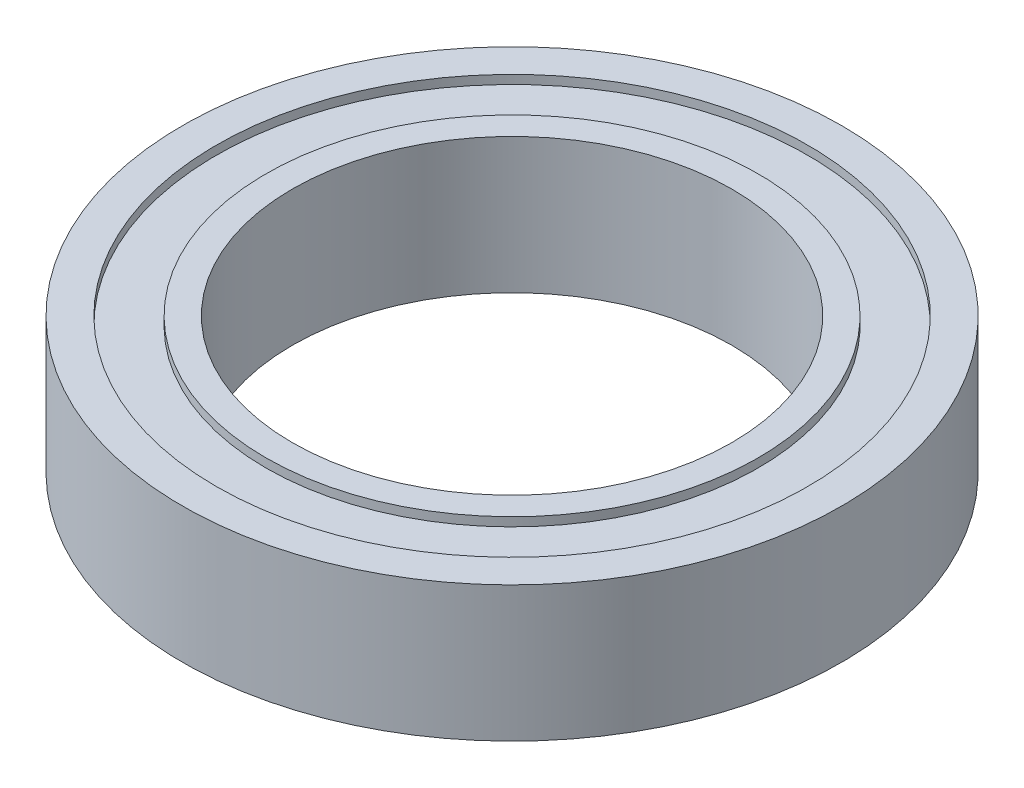
ISO-10303-21;
HEADER;
FILE_DESCRIPTION(('STEP AP214'),'2;1');
FILE_NAME('part.step','',(''),(''),'','','');
FILE_SCHEMA(('AUTOMOTIVE_DESIGN { 1 0 10303 214 1 1 1 1 }'));
ENDSEC;
DATA;
#1=APPLICATION_CONTEXT('core data for automotive mechanical design processes');
#2=APPLICATION_PROTOCOL_DEFINITION('international standard','automotive_design',2000,#1);
#3=PRODUCT_CONTEXT('',#1,'mechanical');
#4=PRODUCT('Part','Part','',(#3));
#5=PRODUCT_RELATED_PRODUCT_CATEGORY('part','',(#4));
#6=PRODUCT_DEFINITION_FORMATION('','',#4);
#7=PRODUCT_DEFINITION_CONTEXT('part definition',#1,'design');
#8=PRODUCT_DEFINITION('design','',#6,#7);
#9=PRODUCT_DEFINITION_SHAPE('','',#8);
#10=(LENGTH_UNIT() NAMED_UNIT(*) SI_UNIT(.MILLI.,.METRE.));
#11=(NAMED_UNIT(*) PLANE_ANGLE_UNIT() SI_UNIT($,.RADIAN.));
#12=(NAMED_UNIT(*) SI_UNIT($,.STERADIAN.) SOLID_ANGLE_UNIT());
#13=UNCERTAINTY_MEASURE_WITH_UNIT(LENGTH_MEASURE(1.E-05),#10,'distance_accuracy_value','');
#14=(GEOMETRIC_REPRESENTATION_CONTEXT(3) GLOBAL_UNCERTAINTY_ASSIGNED_CONTEXT((#13)) GLOBAL_UNIT_ASSIGNED_CONTEXT((#10,
#11,#12)) REPRESENTATION_CONTEXT('',''));
#15=CARTESIAN_POINT('',(0.,0.,0.));
#16=DIRECTION('',(0.,0.,1.));
#17=DIRECTION('',(1.,0.,0.));
#18=AXIS2_PLACEMENT_3D('',#15,#16,#17);
#19=CARTESIAN_POINT('',(0.,3.91160000000002,0.));
#20=DIRECTION('',(0.,-1.,0.));
#21=DIRECTION('',(0.,0.,-1.));
#22=AXIS2_PLACEMENT_3D('',#19,#20,#21);
#23=CYLINDRICAL_SURFACE('',#22,6.35);
#24=CARTESIAN_POINT('',(0.,0.,0.));
#25=DIRECTION('',(0.,-1.,0.));
#26=DIRECTION('',(0.,0.,-1.));
#27=AXIS2_PLACEMENT_3D('',#24,#25,#26);
#28=CIRCLE('',#27,6.35);
#29=CARTESIAN_POINT('',(0.,0.,-6.35));
#30=VERTEX_POINT('',#29);
#31=EDGE_CURVE('E51',#30,#30,#28,.T.);
#32=ORIENTED_EDGE('',*,*,#31,.T.);
#33=EDGE_LOOP('',(#32));
#34=FACE_BOUND('',#33,.T.);
#35=CARTESIAN_POINT('',(0.,3.91160000000002,0.));
#36=DIRECTION('',(0.,-1.,0.));
#37=DIRECTION('',(0.,0.,-1.));
#38=AXIS2_PLACEMENT_3D('',#35,#36,#37);
#39=CIRCLE('',#38,6.35);
#40=CARTESIAN_POINT('',(0.,3.91160000000002,-6.35));
#41=VERTEX_POINT('',#40);
#42=EDGE_CURVE('E17',#41,#41,#39,.T.);
#43=ORIENTED_EDGE('',*,*,#42,.F.);
#44=EDGE_LOOP('',(#43));
#45=FACE_BOUND('',#44,.T.);
#46=ADVANCED_FACE('F14',(#34,#45),#23,.F.);
#47=CARTESIAN_POINT('',(0.,3.91160000000002,0.));
#48=DIRECTION('',(0.,1.,0.));
#49=DIRECTION('',(0.,0.,1.));
#50=AXIS2_PLACEMENT_3D('',#47,#48,#49);
#51=PLANE('',#50);
#52=CARTESIAN_POINT('',(0.,3.91160000000002,0.));
#53=DIRECTION('',(0.,1.,0.));
#54=DIRECTION('',(0.,0.,1.));
#55=AXIS2_PLACEMENT_3D('',#52,#53,#54);
#56=CIRCLE('',#55,7.112);
#57=CARTESIAN_POINT('',(0.,3.91160000000002,7.112));
#58=VERTEX_POINT('',#57);
#59=EDGE_CURVE('E49',#58,#58,#56,.F.);
#60=ORIENTED_EDGE('',*,*,#59,.F.);
#61=EDGE_LOOP('',(#60));
#62=FACE_BOUND('',#61,.T.);
#63=ORIENTED_EDGE('',*,*,#42,.T.);
#64=EDGE_LOOP('',(#63));
#65=FACE_BOUND('',#64,.T.);
#66=ADVANCED_FACE('F58',(#62,#65),#51,.T.);
#67=CARTESIAN_POINT('',(0.,0.,0.));
#68=DIRECTION('',(0.,1.,0.));
#69=DIRECTION('',(0.,0.,1.));
#70=AXIS2_PLACEMENT_3D('',#67,#68,#69);
#71=PLANE('',#70);
#72=CARTESIAN_POINT('',(0.,0.,0.));
#73=DIRECTION('',(0.,-1.,0.));
#74=DIRECTION('',(0.,0.,-1.));
#75=AXIS2_PLACEMENT_3D('',#72,#73,#74);
#76=CIRCLE('',#75,7.112);
#77=CARTESIAN_POINT('',(0.,0.,-7.112));
#78=VERTEX_POINT('',#77);
#79=EDGE_CURVE('E46',#78,#78,#76,.F.);
#80=ORIENTED_EDGE('',*,*,#79,.F.);
#81=EDGE_LOOP('',(#80));
#82=FACE_BOUND('',#81,.T.);
#83=ORIENTED_EDGE('',*,*,#31,.F.);
#84=EDGE_LOOP('',(#83));
#85=FACE_BOUND('',#84,.T.);
#86=ADVANCED_FACE('F65',(#82,#85),#71,.F.);
#87=CARTESIAN_POINT('',(0.,3.65759999999998,0.));
#88=DIRECTION('',(0.,1.,0.));
#89=DIRECTION('',(0.,0.,1.));
#90=AXIS2_PLACEMENT_3D('',#87,#88,#89);
#91=CYLINDRICAL_SURFACE('',#90,7.112);
#92=CARTESIAN_POINT('',(0.,3.65759999999998,0.));
#93=DIRECTION('',(0.,1.,0.));
#94=DIRECTION('',(0.,0.,1.));
#95=AXIS2_PLACEMENT_3D('',#92,#93,#94);
#96=CIRCLE('',#95,7.112);
#97=CARTESIAN_POINT('',(0.,3.65759999999998,7.112));
#98=VERTEX_POINT('',#97);
#99=EDGE_CURVE('E43',#98,#98,#96,.F.);
#100=ORIENTED_EDGE('',*,*,#99,.F.);
#101=EDGE_LOOP('',(#100));
#102=FACE_BOUND('',#101,.T.);
#103=ORIENTED_EDGE('',*,*,#59,.T.);
#104=EDGE_LOOP('',(#103));
#105=FACE_BOUND('',#104,.T.);
#106=ADVANCED_FACE('F101',(#102,#105),#91,.T.);
#107=CARTESIAN_POINT('',(0.,0.253999999999976,0.));
#108=DIRECTION('',(0.,-1.,0.));
#109=DIRECTION('',(0.,0.,-1.));
#110=AXIS2_PLACEMENT_3D('',#107,#108,#109);
#111=CYLINDRICAL_SURFACE('',#110,7.112);
#112=CARTESIAN_POINT('',(0.,0.253999999999976,0.));
#113=DIRECTION('',(0.,-1.,0.));
#114=DIRECTION('',(0.,0.,-1.));
#115=AXIS2_PLACEMENT_3D('',#112,#113,#114);
#116=CIRCLE('',#115,7.112);
#117=CARTESIAN_POINT('',(0.,0.253999999999976,-7.112));
#118=VERTEX_POINT('',#117);
#119=EDGE_CURVE('E40',#118,#118,#116,.F.);
#120=ORIENTED_EDGE('',*,*,#119,.F.);
#121=EDGE_LOOP('',(#120));
#122=FACE_BOUND('',#121,.T.);
#123=ORIENTED_EDGE('',*,*,#79,.T.);
#124=EDGE_LOOP('',(#123));
#125=FACE_BOUND('',#124,.T.);
#126=ADVANCED_FACE('F97',(#122,#125),#111,.T.);
#127=CARTESIAN_POINT('',(0.,3.65759999999998,0.));
#128=DIRECTION('',(0.,1.,0.));
#129=DIRECTION('',(0.,0.,1.));
#130=AXIS2_PLACEMENT_3D('',#127,#128,#129);
#131=PLANE('',#130);
#132=CARTESIAN_POINT('',(0.,3.65759999999998,0.));
#133=DIRECTION('',(0.,1.,0.));
#134=DIRECTION('',(0.,0.,1.));
#135=AXIS2_PLACEMENT_3D('',#132,#133,#134);
#136=CIRCLE('',#135,8.5471);
#137=CARTESIAN_POINT('',(0.,3.65759999999998,8.5471));
#138=VERTEX_POINT('',#137);
#139=EDGE_CURVE('E37',#138,#138,#136,.T.);
#140=ORIENTED_EDGE('',*,*,#139,.T.);
#141=EDGE_LOOP('',(#140));
#142=FACE_BOUND('',#141,.T.);
#143=ORIENTED_EDGE('',*,*,#99,.T.);
#144=EDGE_LOOP('',(#143));
#145=FACE_BOUND('',#144,.T.);
#146=ADVANCED_FACE('F93',(#142,#145),#131,.T.);
#147=CARTESIAN_POINT('',(0.,0.253999999999976,0.));
#148=DIRECTION('',(0.,-1.,0.));
#149=DIRECTION('',(0.,0.,-1.));
#150=AXIS2_PLACEMENT_3D('',#147,#148,#149);
#151=PLANE('',#150);
#152=CARTESIAN_POINT('',(0.,0.253999999999976,0.));
#153=DIRECTION('',(0.,-1.,0.));
#154=DIRECTION('',(0.,0.,-1.));
#155=AXIS2_PLACEMENT_3D('',#152,#153,#154);
#156=CIRCLE('',#155,8.5471);
#157=CARTESIAN_POINT('',(0.,0.253999999999976,-8.5471));
#158=VERTEX_POINT('',#157);
#159=EDGE_CURVE('E34',#158,#158,#156,.T.);
#160=ORIENTED_EDGE('',*,*,#159,.T.);
#161=EDGE_LOOP('',(#160));
#162=FACE_BOUND('',#161,.T.);
#163=ORIENTED_EDGE('',*,*,#119,.T.);
#164=EDGE_LOOP('',(#163));
#165=FACE_BOUND('',#164,.T.);
#166=ADVANCED_FACE('F89',(#162,#165),#151,.T.);
#167=CARTESIAN_POINT('',(0.,3.65759999999998,0.));
#168=DIRECTION('',(0.,1.,0.));
#169=DIRECTION('',(0.,0.,1.));
#170=AXIS2_PLACEMENT_3D('',#167,#168,#169);
#171=CYLINDRICAL_SURFACE('',#170,8.5471);
#172=CARTESIAN_POINT('',(0.,3.91160000000002,0.));
#173=DIRECTION('',(0.,1.,0.));
#174=DIRECTION('',(0.,0.,1.));
#175=AXIS2_PLACEMENT_3D('',#172,#173,#174);
#176=CIRCLE('',#175,8.5471);
#177=CARTESIAN_POINT('',(0.,3.91160000000002,8.5471));
#178=VERTEX_POINT('',#177);
#179=EDGE_CURVE('E31',#178,#178,#176,.F.);
#180=ORIENTED_EDGE('',*,*,#179,.F.);
#181=EDGE_LOOP('',(#180));
#182=FACE_BOUND('',#181,.T.);
#183=ORIENTED_EDGE('',*,*,#139,.F.);
#184=EDGE_LOOP('',(#183));
#185=FACE_BOUND('',#184,.T.);
#186=ADVANCED_FACE('F85',(#182,#185),#171,.F.);
#187=CARTESIAN_POINT('',(0.,0.253999999999976,0.));
#188=DIRECTION('',(0.,-1.,0.));
#189=DIRECTION('',(0.,0.,-1.));
#190=AXIS2_PLACEMENT_3D('',#187,#188,#189);
#191=CYLINDRICAL_SURFACE('',#190,8.5471);
#192=ORIENTED_EDGE('',*,*,#159,.F.);
#193=EDGE_LOOP('',(#192));
#194=FACE_BOUND('',#193,.T.);
#195=CARTESIAN_POINT('',(0.,0.,0.));
#196=DIRECTION('',(0.,-1.,0.));
#197=DIRECTION('',(0.,0.,-1.));
#198=AXIS2_PLACEMENT_3D('',#195,#196,#197);
#199=CIRCLE('',#198,8.5471);
#200=CARTESIAN_POINT('',(0.,0.,-8.5471));
#201=VERTEX_POINT('',#200);
#202=EDGE_CURVE('E26',#201,#201,#199,.T.);
#203=ORIENTED_EDGE('',*,*,#202,.T.);
#204=EDGE_LOOP('',(#203));
#205=FACE_BOUND('',#204,.T.);
#206=ADVANCED_FACE('F81',(#194,#205),#191,.F.);
#207=CARTESIAN_POINT('',(0.,3.91160000000002,0.));
#208=DIRECTION('',(0.,1.,0.));
#209=DIRECTION('',(0.,0.,1.));
#210=AXIS2_PLACEMENT_3D('',#207,#208,#209);
#211=PLANE('',#210);
#212=CARTESIAN_POINT('',(0.,3.91160000000002,0.));
#213=DIRECTION('',(0.,-1.,0.));
#214=DIRECTION('',(0.,0.,-1.));
#215=AXIS2_PLACEMENT_3D('',#212,#213,#214);
#216=CIRCLE('',#215,9.525);
#217=CARTESIAN_POINT('',(0.,3.91160000000002,-9.525));
#218=VERTEX_POINT('',#217);
#219=EDGE_CURVE('E21',#218,#218,#216,.T.);
#220=ORIENTED_EDGE('',*,*,#219,.F.);
#221=EDGE_LOOP('',(#220));
#222=FACE_BOUND('',#221,.T.);
#223=ORIENTED_EDGE('',*,*,#179,.T.);
#224=EDGE_LOOP('',(#223));
#225=FACE_BOUND('',#224,.T.);
#226=ADVANCED_FACE('F74',(#222,#225),#211,.T.);
#227=CARTESIAN_POINT('',(0.,0.,0.));
#228=DIRECTION('',(0.,1.,0.));
#229=DIRECTION('',(0.,0.,1.));
#230=AXIS2_PLACEMENT_3D('',#227,#228,#229);
#231=PLANE('',#230);
#232=CARTESIAN_POINT('',(0.,0.,0.));
#233=DIRECTION('',(0.,-1.,0.));
#234=DIRECTION('',(0.,0.,-1.));
#235=AXIS2_PLACEMENT_3D('',#232,#233,#234);
#236=CIRCLE('',#235,9.525);
#237=CARTESIAN_POINT('',(0.,0.,-9.525));
#238=VERTEX_POINT('',#237);
#239=EDGE_CURVE('E10',#238,#238,#236,.F.);
#240=ORIENTED_EDGE('',*,*,#239,.F.);
#241=EDGE_LOOP('',(#240));
#242=FACE_BOUND('',#241,.T.);
#243=ORIENTED_EDGE('',*,*,#202,.F.);
#244=EDGE_LOOP('',(#243));
#245=FACE_BOUND('',#244,.T.);
#246=ADVANCED_FACE('F69',(#242,#245),#231,.F.);
#247=CARTESIAN_POINT('',(0.,3.91160000000002,0.));
#248=DIRECTION('',(0.,-1.,0.));
#249=DIRECTION('',(0.,0.,-1.));
#250=AXIS2_PLACEMENT_3D('',#247,#248,#249);
#251=CYLINDRICAL_SURFACE('',#250,9.525);
#252=ORIENTED_EDGE('',*,*,#239,.T.);
#253=EDGE_LOOP('',(#252));
#254=FACE_BOUND('',#253,.T.);
#255=ORIENTED_EDGE('',*,*,#219,.T.);
#256=EDGE_LOOP('',(#255));
#257=FACE_BOUND('',#256,.T.);
#258=ADVANCED_FACE('F67',(#254,#257),#251,.T.);
#259=CLOSED_SHELL('',(#46,#66,#86,#106,#126,#146,#166,#186,#206,#226,#246,#258));
#260=MANIFOLD_SOLID_BREP('B1',#259);
#261=ADVANCED_BREP_SHAPE_REPRESENTATION('',(#18,#260),#14);
#262=SHAPE_DEFINITION_REPRESENTATION(#9,#261);
ENDSEC;
END-ISO-10303-21;
